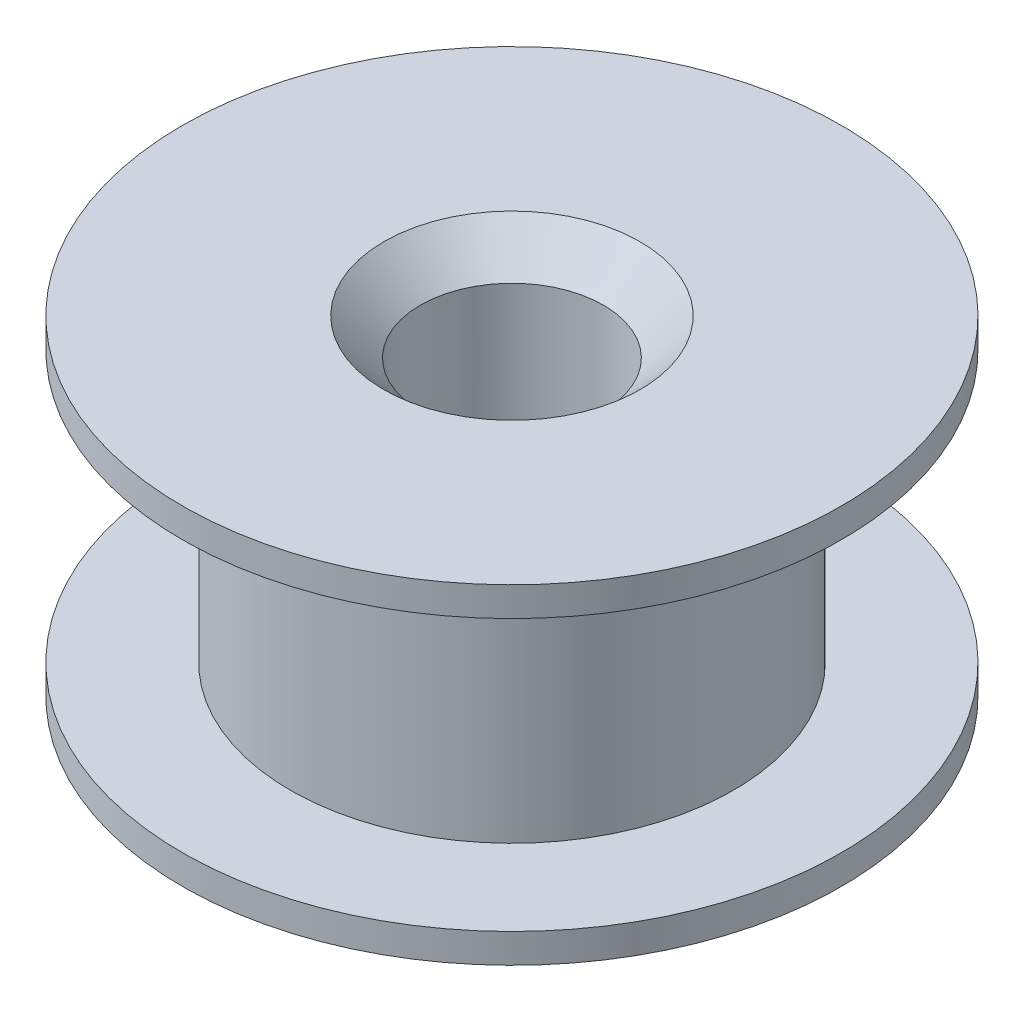
ISO-10303-21;
HEADER;
FILE_DESCRIPTION(('STEP AP214'),'2;1');
FILE_NAME('part.step','',(''),(''),'','','');
FILE_SCHEMA(('AUTOMOTIVE_DESIGN { 1 0 10303 214 1 1 1 1 }'));
ENDSEC;
DATA;
#1=APPLICATION_CONTEXT('core data for automotive mechanical design processes');
#2=APPLICATION_PROTOCOL_DEFINITION('international standard','automotive_design',2000,#1);
#3=PRODUCT_CONTEXT('',#1,'mechanical');
#4=PRODUCT('Part','Part','',(#3));
#5=PRODUCT_RELATED_PRODUCT_CATEGORY('part','',(#4));
#6=PRODUCT_DEFINITION_FORMATION('','',#4);
#7=PRODUCT_DEFINITION_CONTEXT('part definition',#1,'design');
#8=PRODUCT_DEFINITION('design','',#6,#7);
#9=PRODUCT_DEFINITION_SHAPE('','',#8);
#10=(LENGTH_UNIT() NAMED_UNIT(*) SI_UNIT(.MILLI.,.METRE.));
#11=(NAMED_UNIT(*) PLANE_ANGLE_UNIT() SI_UNIT($,.RADIAN.));
#12=(NAMED_UNIT(*) SI_UNIT($,.STERADIAN.) SOLID_ANGLE_UNIT());
#13=UNCERTAINTY_MEASURE_WITH_UNIT(LENGTH_MEASURE(1.E-05),#10,'distance_accuracy_value','');
#14=(GEOMETRIC_REPRESENTATION_CONTEXT(3) GLOBAL_UNCERTAINTY_ASSIGNED_CONTEXT((#13)) GLOBAL_UNIT_ASSIGNED_CONTEXT((#10,
#11,#12)) REPRESENTATION_CONTEXT('',''));
#15=CARTESIAN_POINT('',(0.,0.,0.));
#16=DIRECTION('',(0.,0.,1.));
#17=DIRECTION('',(1.,0.,0.));
#18=AXIS2_PLACEMENT_3D('',#15,#16,#17);
#19=CARTESIAN_POINT('',(0.,9.,0.));
#20=DIRECTION('',(0.,1.,0.));
#21=DIRECTION('',(-1.,0.,0.));
#22=AXIS2_PLACEMENT_3D('',#19,#20,#21);
#23=CYLINDRICAL_SURFACE('',#22,9.);
#24=CARTESIAN_POINT('',(0.,0.,0.));
#25=DIRECTION('',(0.,1.,0.));
#26=DIRECTION('',(-1.,0.,0.));
#27=AXIS2_PLACEMENT_3D('',#24,#25,#26);
#28=CIRCLE('',#27,9.);
#29=CARTESIAN_POINT('',(-9.,0.,0.));
#30=VERTEX_POINT('',#29);
#31=EDGE_CURVE('E69',#30,#30,#28,.T.);
#32=ORIENTED_EDGE('',*,*,#31,.T.);
#33=EDGE_LOOP('',(#32));
#34=FACE_BOUND('',#33,.T.);
#35=CARTESIAN_POINT('',(0.,0.799999999999999,0.));
#36=DIRECTION('',(0.,1.,0.));
#37=DIRECTION('',(-1.,0.,0.));
#38=AXIS2_PLACEMENT_3D('',#35,#36,#37);
#39=CIRCLE('',#38,9.);
#40=CARTESIAN_POINT('',(-9.,0.799999999999999,0.));
#41=VERTEX_POINT('',#40);
#42=EDGE_CURVE('E54',#41,#41,#39,.T.);
#43=ORIENTED_EDGE('',*,*,#42,.F.);
#44=EDGE_LOOP('',(#43));
#45=FACE_BOUND('',#44,.T.);
#46=ADVANCED_FACE('F34',(#34,#45),#23,.T.);
#47=CARTESIAN_POINT('',(-9.,0.799999999999999,0.));
#48=DIRECTION('',(0.,1.,0.));
#49=DIRECTION('',(-1.,0.,0.));
#50=AXIS2_PLACEMENT_3D('',#47,#48,#49);
#51=PLANE('',#50);
#52=ORIENTED_EDGE('',*,*,#42,.T.);
#53=EDGE_LOOP('',(#52));
#54=FACE_BOUND('',#53,.T.);
#55=CARTESIAN_POINT('',(0.,0.799999999999999,0.));
#56=DIRECTION('',(0.,1.,0.));
#57=DIRECTION('',(-1.,0.,0.));
#58=AXIS2_PLACEMENT_3D('',#55,#56,#57);
#59=CIRCLE('',#58,6.05);
#60=CARTESIAN_POINT('',(-6.05,0.799999999999999,0.));
#61=VERTEX_POINT('',#60);
#62=EDGE_CURVE('E57',#61,#61,#59,.T.);
#63=ORIENTED_EDGE('',*,*,#62,.F.);
#64=EDGE_LOOP('',(#63));
#65=FACE_BOUND('',#64,.T.);
#66=ADVANCED_FACE('F89',(#54,#65),#51,.T.);
#67=CARTESIAN_POINT('',(0.,9.,0.));
#68=DIRECTION('',(0.,1.,0.));
#69=DIRECTION('',(-1.,0.,0.));
#70=AXIS2_PLACEMENT_3D('',#67,#68,#69);
#71=CYLINDRICAL_SURFACE('',#70,6.05);
#72=ORIENTED_EDGE('',*,*,#62,.T.);
#73=EDGE_LOOP('',(#72));
#74=FACE_BOUND('',#73,.T.);
#75=CARTESIAN_POINT('',(0.,8.2,0.));
#76=DIRECTION('',(0.,1.,0.));
#77=DIRECTION('',(-1.,0.,0.));
#78=AXIS2_PLACEMENT_3D('',#75,#76,#77);
#79=CIRCLE('',#78,6.05);
#80=CARTESIAN_POINT('',(-6.05,8.2,0.));
#81=VERTEX_POINT('',#80);
#82=EDGE_CURVE('E60',#81,#81,#79,.T.);
#83=ORIENTED_EDGE('',*,*,#82,.F.);
#84=EDGE_LOOP('',(#83));
#85=FACE_BOUND('',#84,.T.);
#86=ADVANCED_FACE('F94',(#74,#85),#71,.T.);
#87=CARTESIAN_POINT('',(-6.05,8.2,0.));
#88=DIRECTION('',(0.,-1.,0.));
#89=DIRECTION('',(1.,0.,0.));
#90=AXIS2_PLACEMENT_3D('',#87,#88,#89);
#91=PLANE('',#90);
#92=ORIENTED_EDGE('',*,*,#82,.T.);
#93=EDGE_LOOP('',(#92));
#94=FACE_BOUND('',#93,.T.);
#95=CARTESIAN_POINT('',(0.,8.2,0.));
#96=DIRECTION('',(0.,1.,0.));
#97=DIRECTION('',(-1.,0.,0.));
#98=AXIS2_PLACEMENT_3D('',#95,#96,#97);
#99=CIRCLE('',#98,9.);
#100=CARTESIAN_POINT('',(-9.,8.2,0.));
#101=VERTEX_POINT('',#100);
#102=EDGE_CURVE('E63',#101,#101,#99,.T.);
#103=ORIENTED_EDGE('',*,*,#102,.F.);
#104=EDGE_LOOP('',(#103));
#105=FACE_BOUND('',#104,.T.);
#106=ADVANCED_FACE('F100',(#94,#105),#91,.T.);
#107=CARTESIAN_POINT('',(0.,9.,0.));
#108=DIRECTION('',(0.,1.,0.));
#109=DIRECTION('',(-1.,0.,0.));
#110=AXIS2_PLACEMENT_3D('',#107,#108,#109);
#111=CYLINDRICAL_SURFACE('',#110,9.);
#112=ORIENTED_EDGE('',*,*,#102,.T.);
#113=EDGE_LOOP('',(#112));
#114=FACE_BOUND('',#113,.T.);
#115=CARTESIAN_POINT('',(0.,9.,0.));
#116=DIRECTION('',(0.,1.,0.));
#117=DIRECTION('',(-1.,0.,0.));
#118=AXIS2_PLACEMENT_3D('',#115,#116,#117);
#119=CIRCLE('',#118,9.);
#120=CARTESIAN_POINT('',(-9.,9.,0.));
#121=VERTEX_POINT('',#120);
#122=EDGE_CURVE('E66',#121,#121,#119,.T.);
#123=ORIENTED_EDGE('',*,*,#122,.F.);
#124=EDGE_LOOP('',(#123));
#125=FACE_BOUND('',#124,.T.);
#126=ADVANCED_FACE('F104',(#114,#125),#111,.T.);
#127=CARTESIAN_POINT('',(-9.,9.,0.));
#128=DIRECTION('',(0.,1.,0.));
#129=DIRECTION('',(-1.,0.,0.));
#130=AXIS2_PLACEMENT_3D('',#127,#128,#129);
#131=PLANE('',#130);
#132=CARTESIAN_POINT('',(0.,9.,0.));
#133=DIRECTION('',(0.,1.,0.));
#134=DIRECTION('',(-1.,0.,0.));
#135=AXIS2_PLACEMENT_3D('',#132,#133,#134);
#136=CIRCLE('',#135,3.5);
#137=CARTESIAN_POINT('',(-3.5,9.,0.));
#138=VERTEX_POINT('',#137);
#139=EDGE_CURVE('E45',#138,#138,#136,.F.);
#140=ORIENTED_EDGE('',*,*,#139,.T.);
#141=EDGE_LOOP('',(#140));
#142=FACE_BOUND('',#141,.T.);
#143=ORIENTED_EDGE('',*,*,#122,.T.);
#144=EDGE_LOOP('',(#143));
#145=FACE_BOUND('',#144,.T.);
#146=ADVANCED_FACE('F86',(#142,#145),#131,.T.);
#147=CARTESIAN_POINT('',(0.,9.,0.));
#148=DIRECTION('',(0.,1.,0.));
#149=DIRECTION('',(-1.,0.,0.));
#150=AXIS2_PLACEMENT_3D('',#147,#148,#149);
#151=CYLINDRICAL_SURFACE('',#150,2.5);
#152=CARTESIAN_POINT('',(0.,1.,0.));
#153=DIRECTION('',(0.,-1.,0.));
#154=DIRECTION('',(1.,0.,0.));
#155=AXIS2_PLACEMENT_3D('',#152,#153,#154);
#156=CIRCLE('',#155,2.5);
#157=CARTESIAN_POINT('',(2.5,1.,0.));
#158=VERTEX_POINT('',#157);
#159=EDGE_CURVE('E10',#158,#158,#156,.T.);
#160=ORIENTED_EDGE('',*,*,#159,.T.);
#161=EDGE_LOOP('',(#160));
#162=FACE_BOUND('',#161,.T.);
#163=CARTESIAN_POINT('',(0.,8.,0.));
#164=DIRECTION('',(0.,1.,0.));
#165=DIRECTION('',(-1.,0.,0.));
#166=AXIS2_PLACEMENT_3D('',#163,#164,#165);
#167=CIRCLE('',#166,2.5);
#168=CARTESIAN_POINT('',(-2.5,8.,0.));
#169=VERTEX_POINT('',#168);
#170=EDGE_CURVE('E49',#169,#169,#167,.T.);
#171=ORIENTED_EDGE('',*,*,#170,.T.);
#172=EDGE_LOOP('',(#171));
#173=FACE_BOUND('',#172,.T.);
#174=ADVANCED_FACE('F78',(#162,#173),#151,.F.);
#175=CARTESIAN_POINT('',(-2.5,0.,0.));
#176=DIRECTION('',(0.,-1.,0.));
#177=DIRECTION('',(1.,0.,0.));
#178=AXIS2_PLACEMENT_3D('',#175,#176,#177);
#179=PLANE('',#178);
#180=CARTESIAN_POINT('',(0.,0.,0.));
#181=DIRECTION('',(0.,-1.,0.));
#182=DIRECTION('',(1.,0.,0.));
#183=AXIS2_PLACEMENT_3D('',#180,#181,#182);
#184=CIRCLE('',#183,3.5);
#185=CARTESIAN_POINT('',(3.5,0.,0.));
#186=VERTEX_POINT('',#185);
#187=EDGE_CURVE('E41',#186,#186,#184,.F.);
#188=ORIENTED_EDGE('',*,*,#187,.T.);
#189=EDGE_LOOP('',(#188));
#190=FACE_BOUND('',#189,.T.);
#191=ORIENTED_EDGE('',*,*,#31,.F.);
#192=EDGE_LOOP('',(#191));
#193=FACE_BOUND('',#192,.T.);
#194=ADVANCED_FACE('F75',(#190,#193),#179,.T.);
#195=CARTESIAN_POINT('',(0.,8.,0.));
#196=DIRECTION('',(0.,1.,0.));
#197=DIRECTION('',(-1.,0.,0.));
#198=AXIS2_PLACEMENT_3D('',#195,#196,#197);
#199=CONICAL_SURFACE('',#198,2.5,0.78539816339745);
#200=ORIENTED_EDGE('',*,*,#139,.F.);
#201=EDGE_LOOP('',(#200));
#202=FACE_BOUND('',#201,.T.);
#203=ORIENTED_EDGE('',*,*,#170,.F.);
#204=EDGE_LOOP('',(#203));
#205=FACE_BOUND('',#204,.T.);
#206=ADVANCED_FACE('F77',(#202,#205),#199,.F.);
#207=CARTESIAN_POINT('',(0.,0.,0.));
#208=DIRECTION('',(0.,-1.,0.));
#209=DIRECTION('',(1.,0.,0.));
#210=AXIS2_PLACEMENT_3D('',#207,#208,#209);
#211=CONICAL_SURFACE('',#210,3.5,0.785398163397446);
#212=ORIENTED_EDGE('',*,*,#159,.F.);
#213=EDGE_LOOP('',(#212));
#214=FACE_BOUND('',#213,.T.);
#215=ORIENTED_EDGE('',*,*,#187,.F.);
#216=EDGE_LOOP('',(#215));
#217=FACE_BOUND('',#216,.T.);
#218=ADVANCED_FACE('F36',(#214,#217),#211,.F.);
#219=CLOSED_SHELL('',(#46,#66,#86,#106,#126,#146,#174,#194,#206,#218));
#220=MANIFOLD_SOLID_BREP('B2',#219);
#221=ADVANCED_BREP_SHAPE_REPRESENTATION('',(#18,#220),#14);
#222=SHAPE_DEFINITION_REPRESENTATION(#9,#221);
ENDSEC;
END-ISO-10303-21;
